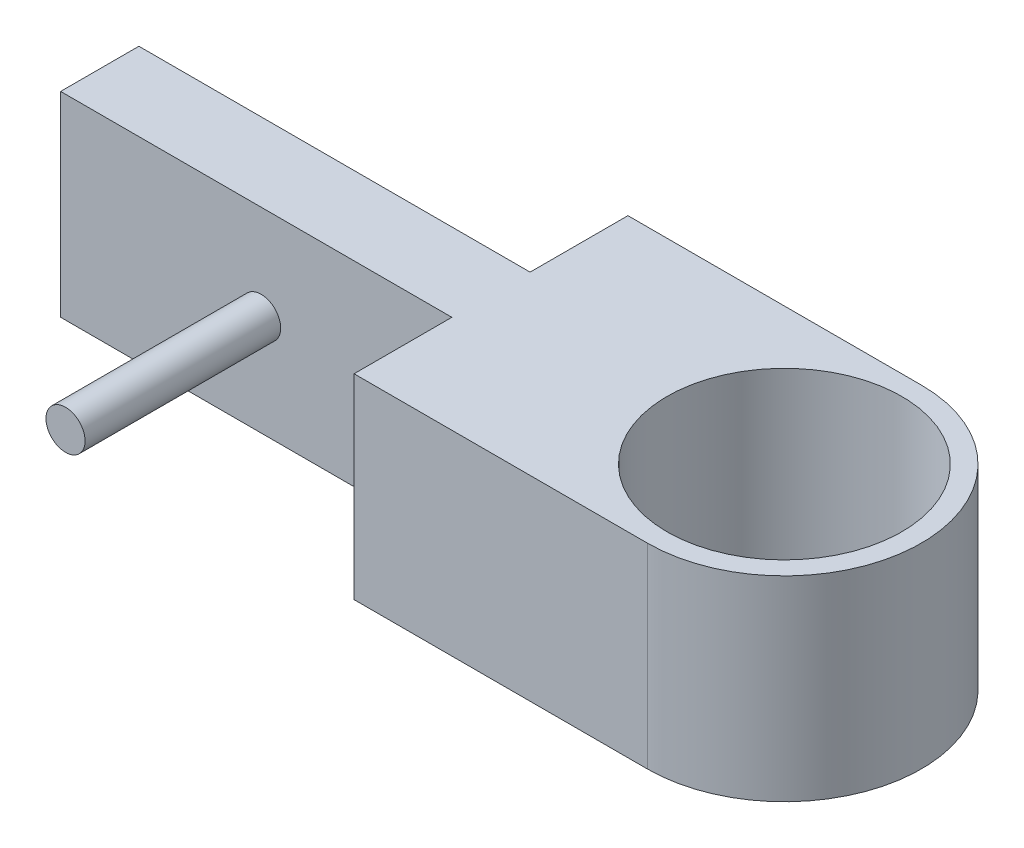
ISO-10303-21;
HEADER;
FILE_DESCRIPTION(('STEP AP214'),'2;1');
FILE_NAME('part.step','',(''),(''),'','','');
FILE_SCHEMA(('AUTOMOTIVE_DESIGN { 1 0 10303 214 1 1 1 1 }'));
ENDSEC;
DATA;
#1=APPLICATION_CONTEXT('core data for automotive mechanical design processes');
#2=APPLICATION_PROTOCOL_DEFINITION('international standard','automotive_design',2000,#1);
#3=PRODUCT_CONTEXT('',#1,'mechanical');
#4=PRODUCT('Part','Part','',(#3));
#5=PRODUCT_RELATED_PRODUCT_CATEGORY('part','',(#4));
#6=PRODUCT_DEFINITION_FORMATION('','',#4);
#7=PRODUCT_DEFINITION_CONTEXT('part definition',#1,'design');
#8=PRODUCT_DEFINITION('design','',#6,#7);
#9=PRODUCT_DEFINITION_SHAPE('','',#8);
#10=(LENGTH_UNIT() NAMED_UNIT(*) SI_UNIT(.MILLI.,.METRE.));
#11=(NAMED_UNIT(*) PLANE_ANGLE_UNIT() SI_UNIT($,.RADIAN.));
#12=(NAMED_UNIT(*) SI_UNIT($,.STERADIAN.) SOLID_ANGLE_UNIT());
#13=UNCERTAINTY_MEASURE_WITH_UNIT(LENGTH_MEASURE(1.E-05),#10,'distance_accuracy_value','');
#14=(GEOMETRIC_REPRESENTATION_CONTEXT(3) GLOBAL_UNCERTAINTY_ASSIGNED_CONTEXT((#13)) GLOBAL_UNIT_ASSIGNED_CONTEXT((#10,
#11,#12)) REPRESENTATION_CONTEXT('',''));
#15=CARTESIAN_POINT('',(0.,0.,0.));
#16=DIRECTION('',(0.,0.,1.));
#17=DIRECTION('',(1.,0.,0.));
#18=AXIS2_PLACEMENT_3D('',#15,#16,#17);
#19=CARTESIAN_POINT('',(0.,10.,-20.3018931857168));
#20=DIRECTION('',(0.,0.,1.));
#21=DIRECTION('',(1.,0.,0.));
#22=AXIS2_PLACEMENT_3D('',#19,#20,#21);
#23=PLANE('',#22);
#24=DIRECTION('',(-1.,0.,0.));
#25=VECTOR('',#24,1.);
#26=CARTESIAN_POINT('',(0.,0.,-20.3018931857168));
#27=LINE('',#26,#25);
#28=CARTESIAN_POINT('',(-56.7727224729383,0.,-20.3018931857168));
#29=VERTEX_POINT('',#28);
#30=CARTESIAN_POINT('',(-76.7727224729383,0.,-20.3018931857168));
#31=VERTEX_POINT('',#30);
#32=EDGE_CURVE('E173',#29,#31,#27,.T.);
#33=ORIENTED_EDGE('',*,*,#32,.F.);
#34=DIRECTION('',(0.,-1.,0.));
#35=VECTOR('',#34,1.);
#36=CARTESIAN_POINT('',(-56.7727224729383,10.,-20.3018931857168));
#37=LINE('',#36,#35);
#38=CARTESIAN_POINT('',(-56.7727224729383,10.,-20.3018931857168));
#39=VERTEX_POINT('',#38);
#40=EDGE_CURVE('E167',#39,#29,#37,.T.);
#41=ORIENTED_EDGE('',*,*,#40,.F.);
#42=DIRECTION('',(-1.,0.,0.));
#43=VECTOR('',#42,1.);
#44=CARTESIAN_POINT('',(0.,10.,-20.3018931857168));
#45=LINE('',#44,#43);
#46=CARTESIAN_POINT('',(-76.7727224729383,10.,-20.3018931857168));
#47=VERTEX_POINT('',#46);
#48=EDGE_CURVE('E171',#39,#47,#45,.T.);
#49=ORIENTED_EDGE('',*,*,#48,.T.);
#50=DIRECTION('',(0.,-1.,0.));
#51=VECTOR('',#50,1.);
#52=CARTESIAN_POINT('',(-76.7727224729383,10.,-20.3018931857168));
#53=LINE('',#52,#51);
#54=EDGE_CURVE('E174',#47,#31,#53,.T.);
#55=ORIENTED_EDGE('',*,*,#54,.T.);
#56=EDGE_LOOP('',(#33,#41,#49,#55));
#57=FACE_BOUND('',#56,.T.);
#58=CARTESIAN_POINT('',(-66.5225803098197,5.14534744583273,-20.3018931857168));
#59=DIRECTION('',(0.,0.,1.));
#60=DIRECTION('',(1.,0.,0.));
#61=AXIS2_PLACEMENT_3D('',#58,#59,#60);
#62=CIRCLE('',#61,0.999999999999998);
#63=CARTESIAN_POINT('',(-65.5225803098197,5.14534744583273,-20.3018931857168));
#64=VERTEX_POINT('',#63);
#65=EDGE_CURVE('E246',#64,#64,#62,.T.);
#66=ORIENTED_EDGE('',*,*,#65,.F.);
#67=EDGE_LOOP('',(#66));
#68=FACE_BOUND('',#67,.T.);
#69=ADVANCED_FACE('F95',(#57,#68),#23,.T.);
#70=CARTESIAN_POINT('',(0.,10.,-29.3018931857168));
#71=DIRECTION('',(0.,0.,1.));
#72=DIRECTION('',(1.,0.,0.));
#73=AXIS2_PLACEMENT_3D('',#70,#71,#72);
#74=PLANE('',#73);
#75=DIRECTION('',(-1.,0.,0.));
#76=VECTOR('',#75,1.);
#77=CARTESIAN_POINT('',(0.,0.,-29.3018931857168));
#78=LINE('',#77,#76);
#79=CARTESIAN_POINT('',(-41.7727224729383,0.,-29.3018931857168));
#80=VERTEX_POINT('',#79);
#81=CARTESIAN_POINT('',(-56.7727224729383,0.,-29.3018931857168));
#82=VERTEX_POINT('',#81);
#83=EDGE_CURVE('E195',#80,#82,#78,.T.);
#84=ORIENTED_EDGE('',*,*,#83,.T.);
#85=DIRECTION('',(0.,-1.,0.));
#86=VECTOR('',#85,1.);
#87=CARTESIAN_POINT('',(-56.7727224729383,10.,-29.3018931857168));
#88=LINE('',#87,#86);
#89=CARTESIAN_POINT('',(-56.7727224729383,10.,-29.3018931857168));
#90=VERTEX_POINT('',#89);
#91=EDGE_CURVE('E105',#90,#82,#88,.T.);
#92=ORIENTED_EDGE('',*,*,#91,.F.);
#93=DIRECTION('',(-1.,0.,0.));
#94=VECTOR('',#93,1.);
#95=CARTESIAN_POINT('',(0.,10.,-29.3018931857168));
#96=LINE('',#95,#94);
#97=CARTESIAN_POINT('',(-41.7727224729383,10.,-29.3018931857168));
#98=VERTEX_POINT('',#97);
#99=EDGE_CURVE('E211',#98,#90,#96,.T.);
#100=ORIENTED_EDGE('',*,*,#99,.F.);
#101=DIRECTION('',(0.,-1.,0.));
#102=VECTOR('',#101,1.);
#103=CARTESIAN_POINT('',(-41.7727224729383,10.,-29.3018931857168));
#104=LINE('',#103,#102);
#105=EDGE_CURVE('E12',#98,#80,#104,.T.);
#106=ORIENTED_EDGE('',*,*,#105,.T.);
#107=EDGE_LOOP('',(#84,#92,#100,#106));
#108=FACE_BOUND('',#107,.T.);
#109=ADVANCED_FACE('F236',(#108),#74,.F.);
#110=CARTESIAN_POINT('',(-56.7727224729382,10.,0.));
#111=DIRECTION('',(1.,0.,0.));
#112=DIRECTION('',(0.,0.,-1.));
#113=AXIS2_PLACEMENT_3D('',#110,#111,#112);
#114=PLANE('',#113);
#115=DIRECTION('',(0.,0.,1.));
#116=VECTOR('',#115,1.);
#117=CARTESIAN_POINT('',(-56.7727224729382,0.,0.));
#118=LINE('',#117,#116);
#119=CARTESIAN_POINT('',(-56.7727224729383,0.,-24.3018931857168));
#120=VERTEX_POINT('',#119);
#121=EDGE_CURVE('E197',#82,#120,#118,.T.);
#122=ORIENTED_EDGE('',*,*,#121,.T.);
#123=DIRECTION('',(0.,-1.,0.));
#124=VECTOR('',#123,1.);
#125=CARTESIAN_POINT('',(-56.7727224729383,10.,-24.3018931857168));
#126=LINE('',#125,#124);
#127=CARTESIAN_POINT('',(-56.7727224729383,10.,-24.3018931857168));
#128=VERTEX_POINT('',#127);
#129=EDGE_CURVE('E217',#128,#120,#126,.T.);
#130=ORIENTED_EDGE('',*,*,#129,.F.);
#131=DIRECTION('',(0.,0.,1.));
#132=VECTOR('',#131,1.);
#133=CARTESIAN_POINT('',(-56.7727224729382,10.,0.));
#134=LINE('',#133,#132);
#135=EDGE_CURVE('E241',#90,#128,#134,.T.);
#136=ORIENTED_EDGE('',*,*,#135,.F.);
#137=ORIENTED_EDGE('',*,*,#91,.T.);
#138=EDGE_LOOP('',(#122,#130,#136,#137));
#139=FACE_BOUND('',#138,.T.);
#140=ADVANCED_FACE('F239',(#139),#114,.F.);
#141=CARTESIAN_POINT('',(0.,10.,-24.3018931857168));
#142=DIRECTION('',(0.,0.,-1.));
#143=DIRECTION('',(-1.,0.,0.));
#144=AXIS2_PLACEMENT_3D('',#141,#142,#143);
#145=PLANE('',#144);
#146=DIRECTION('',(1.,0.,0.));
#147=VECTOR('',#146,1.);
#148=CARTESIAN_POINT('',(0.,0.,-24.3018931857168));
#149=LINE('',#148,#147);
#150=CARTESIAN_POINT('',(-76.7727224729383,0.,-24.3018931857168));
#151=VERTEX_POINT('',#150);
#152=EDGE_CURVE('E201',#151,#120,#149,.T.);
#153=ORIENTED_EDGE('',*,*,#152,.F.);
#154=DIRECTION('',(0.,-1.,0.));
#155=VECTOR('',#154,1.);
#156=CARTESIAN_POINT('',(-76.7727224729383,10.,-24.3018931857168));
#157=LINE('',#156,#155);
#158=CARTESIAN_POINT('',(-76.7727224729383,10.,-24.3018931857168));
#159=VERTEX_POINT('',#158);
#160=EDGE_CURVE('E215',#159,#151,#157,.T.);
#161=ORIENTED_EDGE('',*,*,#160,.F.);
#162=DIRECTION('',(1.,0.,0.));
#163=VECTOR('',#162,1.);
#164=CARTESIAN_POINT('',(0.,10.,-24.3018931857168));
#165=LINE('',#164,#163);
#166=EDGE_CURVE('E190',#159,#128,#165,.T.);
#167=ORIENTED_EDGE('',*,*,#166,.T.);
#168=ORIENTED_EDGE('',*,*,#129,.T.);
#169=EDGE_LOOP('',(#153,#161,#167,#168));
#170=FACE_BOUND('',#169,.T.);
#171=ADVANCED_FACE('F272',(#170),#145,.T.);
#172=CARTESIAN_POINT('',(-76.7727224729383,10.,0.));
#173=DIRECTION('',(-1.,0.,0.));
#174=DIRECTION('',(0.,0.,1.));
#175=AXIS2_PLACEMENT_3D('',#172,#173,#174);
#176=PLANE('',#175);
#177=DIRECTION('',(0.,0.,-1.));
#178=VECTOR('',#177,1.);
#179=CARTESIAN_POINT('',(-76.7727224729383,0.,0.));
#180=LINE('',#179,#178);
#181=EDGE_CURVE('E204',#31,#151,#180,.T.);
#182=ORIENTED_EDGE('',*,*,#181,.F.);
#183=ORIENTED_EDGE('',*,*,#54,.F.);
#184=DIRECTION('',(0.,0.,-1.));
#185=VECTOR('',#184,1.);
#186=CARTESIAN_POINT('',(-76.7727224729383,10.,0.));
#187=LINE('',#186,#185);
#188=EDGE_CURVE('E188',#47,#159,#187,.T.);
#189=ORIENTED_EDGE('',*,*,#188,.T.);
#190=ORIENTED_EDGE('',*,*,#160,.T.);
#191=EDGE_LOOP('',(#182,#183,#189,#190));
#192=FACE_BOUND('',#191,.T.);
#193=ADVANCED_FACE('F269',(#192),#176,.T.);
#194=CARTESIAN_POINT('',(-56.7727224729383,10.,-1.57575959150276E-13));
#195=DIRECTION('',(1.,0.,0.));
#196=DIRECTION('',(0.,0.,-1.));
#197=AXIS2_PLACEMENT_3D('',#194,#195,#196);
#198=PLANE('',#197);
#199=DIRECTION('',(0.,0.,1.));
#200=VECTOR('',#199,1.);
#201=CARTESIAN_POINT('',(-56.7727224729383,0.,-1.57575959150276E-13));
#202=LINE('',#201,#200);
#203=CARTESIAN_POINT('',(-56.7727224729383,0.,-15.3018931857168));
#204=VERTEX_POINT('',#203);
#205=EDGE_CURVE('E142',#29,#204,#202,.T.);
#206=ORIENTED_EDGE('',*,*,#205,.T.);
#207=DIRECTION('',(0.,-1.,0.));
#208=VECTOR('',#207,1.);
#209=CARTESIAN_POINT('',(-56.7727224729383,10.,-15.3018931857168));
#210=LINE('',#209,#208);
#211=CARTESIAN_POINT('',(-56.7727224729383,10.,-15.3018931857168));
#212=VERTEX_POINT('',#211);
#213=EDGE_CURVE('E175',#212,#204,#210,.T.);
#214=ORIENTED_EDGE('',*,*,#213,.F.);
#215=DIRECTION('',(0.,0.,1.));
#216=VECTOR('',#215,1.);
#217=CARTESIAN_POINT('',(-56.7727224729383,10.,-1.57575959150276E-13));
#218=LINE('',#217,#216);
#219=EDGE_CURVE('E177',#39,#212,#218,.T.);
#220=ORIENTED_EDGE('',*,*,#219,.F.);
#221=ORIENTED_EDGE('',*,*,#40,.T.);
#222=EDGE_LOOP('',(#206,#214,#220,#221));
#223=FACE_BOUND('',#222,.T.);
#224=ADVANCED_FACE('F178',(#223),#198,.F.);
#225=CARTESIAN_POINT('',(0.,10.,-15.3018931857168));
#226=DIRECTION('',(0.,0.,-1.));
#227=DIRECTION('',(-1.,0.,0.));
#228=AXIS2_PLACEMENT_3D('',#225,#226,#227);
#229=PLANE('',#228);
#230=DIRECTION('',(1.,0.,0.));
#231=VECTOR('',#230,1.);
#232=CARTESIAN_POINT('',(0.,0.,-15.3018931857168));
#233=LINE('',#232,#231);
#234=CARTESIAN_POINT('',(-41.7727224729383,0.,-15.3018931857168));
#235=VERTEX_POINT('',#234);
#236=EDGE_CURVE('E209',#204,#235,#233,.T.);
#237=ORIENTED_EDGE('',*,*,#236,.T.);
#238=DIRECTION('',(0.,-1.,0.));
#239=VECTOR('',#238,1.);
#240=CARTESIAN_POINT('',(-41.7727224729383,10.,-15.3018931857168));
#241=LINE('',#240,#239);
#242=CARTESIAN_POINT('',(-41.7727224729383,10.,-15.3018931857168));
#243=VERTEX_POINT('',#242);
#244=EDGE_CURVE('E114',#243,#235,#241,.T.);
#245=ORIENTED_EDGE('',*,*,#244,.F.);
#246=DIRECTION('',(1.,0.,0.));
#247=VECTOR('',#246,1.);
#248=CARTESIAN_POINT('',(0.,10.,-15.3018931857168));
#249=LINE('',#248,#247);
#250=EDGE_CURVE('E181',#212,#243,#249,.T.);
#251=ORIENTED_EDGE('',*,*,#250,.F.);
#252=ORIENTED_EDGE('',*,*,#213,.T.);
#253=EDGE_LOOP('',(#237,#245,#251,#252));
#254=FACE_BOUND('',#253,.T.);
#255=ADVANCED_FACE('F289',(#254),#229,.F.);
#256=CARTESIAN_POINT('',(0.,0.,0.));
#257=DIRECTION('',(0.,1.,0.));
#258=DIRECTION('',(0.,0.,1.));
#259=AXIS2_PLACEMENT_3D('',#256,#257,#258);
#260=PLANE('',#259);
#261=ORIENTED_EDGE('',*,*,#83,.F.);
#262=CARTESIAN_POINT('',(-41.7727224729383,0.,-22.3018931857168));
#263=DIRECTION('',(0.,1.,0.));
#264=DIRECTION('',(0.,0.,1.));
#265=AXIS2_PLACEMENT_3D('',#262,#263,#264);
#266=CIRCLE('',#265,7.);
#267=EDGE_CURVE('E99',#235,#80,#266,.T.);
#268=ORIENTED_EDGE('',*,*,#267,.F.);
#269=ORIENTED_EDGE('',*,*,#236,.F.);
#270=ORIENTED_EDGE('',*,*,#205,.F.);
#271=ORIENTED_EDGE('',*,*,#32,.T.);
#272=ORIENTED_EDGE('',*,*,#181,.T.);
#273=ORIENTED_EDGE('',*,*,#152,.T.);
#274=ORIENTED_EDGE('',*,*,#121,.F.);
#275=EDGE_LOOP('',(#261,#268,#269,#270,#271,#272,#273,#274));
#276=FACE_BOUND('',#275,.T.);
#277=CARTESIAN_POINT('',(-41.7727224729383,0.,-22.3018931857168));
#278=DIRECTION('',(0.,1.,0.));
#279=DIRECTION('',(0.,0.,1.));
#280=AXIS2_PLACEMENT_3D('',#277,#278,#279);
#281=CIRCLE('',#280,5.99999999999999);
#282=CARTESIAN_POINT('',(-41.7727224729383,0.,-16.3018931857168));
#283=VERTEX_POINT('',#282);
#284=EDGE_CURVE('E224',#283,#283,#281,.T.);
#285=ORIENTED_EDGE('',*,*,#284,.T.);
#286=EDGE_LOOP('',(#285));
#287=FACE_BOUND('',#286,.T.);
#288=ADVANCED_FACE('F232',(#276,#287),#260,.F.);
#289=CARTESIAN_POINT('',(0.,10.,0.));
#290=DIRECTION('',(0.,1.,0.));
#291=DIRECTION('',(0.,0.,1.));
#292=AXIS2_PLACEMENT_3D('',#289,#290,#291);
#293=PLANE('',#292);
#294=ORIENTED_EDGE('',*,*,#250,.T.);
#295=CARTESIAN_POINT('',(-41.7727224729383,10.,-22.3018931857168));
#296=DIRECTION('',(0.,1.,0.));
#297=DIRECTION('',(0.,0.,1.));
#298=AXIS2_PLACEMENT_3D('',#295,#296,#297);
#299=CIRCLE('',#298,7.);
#300=EDGE_CURVE('E198',#243,#98,#299,.T.);
#301=ORIENTED_EDGE('',*,*,#300,.T.);
#302=ORIENTED_EDGE('',*,*,#99,.T.);
#303=ORIENTED_EDGE('',*,*,#135,.T.);
#304=ORIENTED_EDGE('',*,*,#166,.F.);
#305=ORIENTED_EDGE('',*,*,#188,.F.);
#306=ORIENTED_EDGE('',*,*,#48,.F.);
#307=ORIENTED_EDGE('',*,*,#219,.T.);
#308=EDGE_LOOP('',(#294,#301,#302,#303,#304,#305,#306,#307));
#309=FACE_BOUND('',#308,.T.);
#310=CARTESIAN_POINT('',(-41.7727224729383,10.,-22.3018931857168));
#311=DIRECTION('',(0.,1.,0.));
#312=DIRECTION('',(0.,0.,1.));
#313=AXIS2_PLACEMENT_3D('',#310,#311,#312);
#314=CIRCLE('',#313,5.99999999999999);
#315=CARTESIAN_POINT('',(-41.7727224729383,10.,-16.3018931857168));
#316=VERTEX_POINT('',#315);
#317=EDGE_CURVE('E221',#316,#316,#314,.T.);
#318=ORIENTED_EDGE('',*,*,#317,.F.);
#319=EDGE_LOOP('',(#318));
#320=FACE_BOUND('',#319,.T.);
#321=ADVANCED_FACE('F184',(#309,#320),#293,.T.);
#322=CARTESIAN_POINT('',(-41.7727224729383,10.,-22.3018931857168));
#323=DIRECTION('',(0.,-1.,0.));
#324=DIRECTION('',(0.,0.,-1.));
#325=AXIS2_PLACEMENT_3D('',#322,#323,#324);
#326=CYLINDRICAL_SURFACE('',#325,5.99999999999999);
#327=ORIENTED_EDGE('',*,*,#317,.T.);
#328=EDGE_LOOP('',(#327));
#329=FACE_BOUND('',#328,.T.);
#330=ORIENTED_EDGE('',*,*,#284,.F.);
#331=EDGE_LOOP('',(#330));
#332=FACE_BOUND('',#331,.T.);
#333=ADVANCED_FACE('F258',(#329,#332),#326,.F.);
#334=CARTESIAN_POINT('',(-41.7727224729383,10.,-22.3018931857168));
#335=DIRECTION('',(0.,-1.,0.));
#336=DIRECTION('',(0.,0.,-1.));
#337=AXIS2_PLACEMENT_3D('',#334,#335,#336);
#338=CYLINDRICAL_SURFACE('',#337,7.);
#339=ORIENTED_EDGE('',*,*,#267,.T.);
#340=ORIENTED_EDGE('',*,*,#105,.F.);
#341=ORIENTED_EDGE('',*,*,#300,.F.);
#342=ORIENTED_EDGE('',*,*,#244,.T.);
#343=EDGE_LOOP('',(#339,#340,#341,#342));
#344=FACE_BOUND('',#343,.T.);
#345=ADVANCED_FACE('F97',(#344),#338,.T.);
#346=CARTESIAN_POINT('',(-66.5225803098197,5.14534744583273,-10.3018931857168));
#347=DIRECTION('',(0.,0.,-1.));
#348=DIRECTION('',(-1.,0.,0.));
#349=AXIS2_PLACEMENT_3D('',#346,#347,#348);
#350=CYLINDRICAL_SURFACE('',#349,0.999999999999998);
#351=CARTESIAN_POINT('',(-66.5225803098197,5.14534744583273,-10.3018931857168));
#352=DIRECTION('',(0.,0.,1.));
#353=DIRECTION('',(1.,0.,0.));
#354=AXIS2_PLACEMENT_3D('',#351,#352,#353);
#355=CIRCLE('',#354,0.999999999999998);
#356=CARTESIAN_POINT('',(-65.5225803098197,5.14534744583273,-10.3018931857168));
#357=VERTEX_POINT('',#356);
#358=EDGE_CURVE('E226',#357,#357,#355,.T.);
#359=ORIENTED_EDGE('',*,*,#358,.F.);
#360=EDGE_LOOP('',(#359));
#361=FACE_BOUND('',#360,.T.);
#362=ORIENTED_EDGE('',*,*,#65,.T.);
#363=EDGE_LOOP('',(#362));
#364=FACE_BOUND('',#363,.T.);
#365=ADVANCED_FACE('F254',(#361,#364),#350,.T.);
#366=CARTESIAN_POINT('',(-66.5225803098197,5.14534744583273,-10.3018931857168));
#367=DIRECTION('',(0.,0.,1.));
#368=DIRECTION('',(1.,0.,0.));
#369=AXIS2_PLACEMENT_3D('',#366,#367,#368);
#370=PLANE('',#369);
#371=ORIENTED_EDGE('',*,*,#358,.T.);
#372=EDGE_LOOP('',(#371));
#373=FACE_BOUND('',#372,.T.);
#374=ADVANCED_FACE('F252',(#373),#370,.T.);
#375=CLOSED_SHELL('',(#69,#109,#140,#171,#193,#224,#255,#288,#321,#333,#345,#365,#374));
#376=MANIFOLD_SOLID_BREP('B2',#375);
#377=ADVANCED_BREP_SHAPE_REPRESENTATION('',(#18,#376),#14);
#378=SHAPE_DEFINITION_REPRESENTATION(#9,#377);
ENDSEC;
END-ISO-10303-21;
